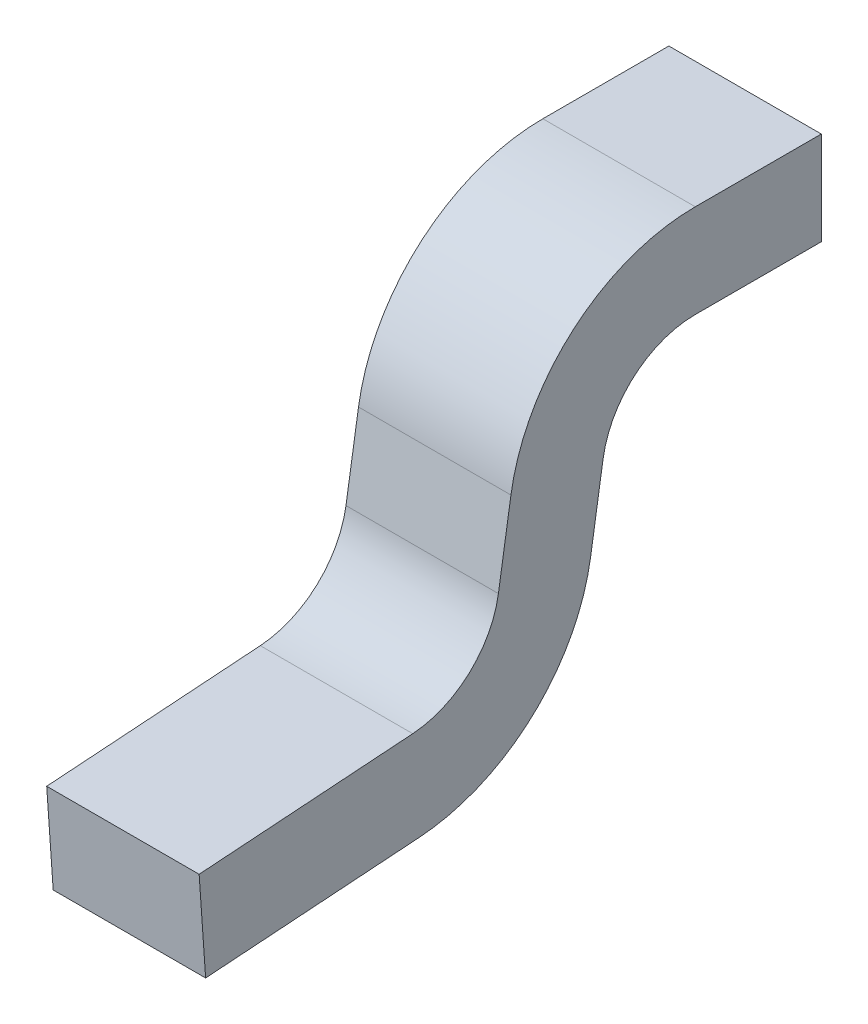
ISO-10303-21;
HEADER;
FILE_DESCRIPTION(('STEP AP214'),'2;1');
FILE_NAME('part.step','',(''),(''),'','','');
FILE_SCHEMA(('AUTOMOTIVE_DESIGN { 1 0 10303 214 1 1 1 1 }'));
ENDSEC;
DATA;
#1=APPLICATION_CONTEXT('core data for automotive mechanical design processes');
#2=APPLICATION_PROTOCOL_DEFINITION('international standard','automotive_design',2000,#1);
#3=PRODUCT_CONTEXT('',#1,'mechanical');
#4=PRODUCT('Part','Part','',(#3));
#5=PRODUCT_RELATED_PRODUCT_CATEGORY('part','',(#4));
#6=PRODUCT_DEFINITION_FORMATION('','',#4);
#7=PRODUCT_DEFINITION_CONTEXT('part definition',#1,'design');
#8=PRODUCT_DEFINITION('design','',#6,#7);
#9=PRODUCT_DEFINITION_SHAPE('','',#8);
#10=(LENGTH_UNIT() NAMED_UNIT(*) SI_UNIT(.MILLI.,.METRE.));
#11=(NAMED_UNIT(*) PLANE_ANGLE_UNIT() SI_UNIT($,.RADIAN.));
#12=(NAMED_UNIT(*) SI_UNIT($,.STERADIAN.) SOLID_ANGLE_UNIT());
#13=UNCERTAINTY_MEASURE_WITH_UNIT(LENGTH_MEASURE(1.E-05),#10,'distance_accuracy_value','');
#14=(GEOMETRIC_REPRESENTATION_CONTEXT(3) GLOBAL_UNCERTAINTY_ASSIGNED_CONTEXT((#13)) GLOBAL_UNIT_ASSIGNED_CONTEXT((#10,
#11,#12)) REPRESENTATION_CONTEXT('',''));
#15=CARTESIAN_POINT('',(0.,0.,0.));
#16=DIRECTION('',(0.,0.,1.));
#17=DIRECTION('',(1.,0.,0.));
#18=AXIS2_PLACEMENT_3D('',#15,#16,#17);
#19=CARTESIAN_POINT('',(0.1225,0.,0.));
#20=DIRECTION('',(1.,0.,0.));
#21=DIRECTION('',(0.,1.,0.));
#22=AXIS2_PLACEMENT_3D('',#19,#20,#21);
#23=PLANE('',#22);
#24=DIRECTION('',(0.,0.98768834059517,-0.156434465040027));
#25=VECTOR('',#24,1.);
#26=CARTESIAN_POINT('',(0.1225,0.04981201057029,0.143980321453));
#27=LINE('',#26,#25);
#28=CARTESIAN_POINT('',(0.1225,0.04981201057029,0.143980321453));
#29=VERTEX_POINT('',#28);
#30=CARTESIAN_POINT('',(0.1225,0.176930339512,0.123846756068));
#31=VERTEX_POINT('',#30);
#32=EDGE_CURVE('E11',#29,#31,#27,.T.);
#33=ORIENTED_EDGE('',*,*,#32,.F.);
#34=CARTESIAN_POINT('',(0.1225,0.07327718032632,0.292133572542));
#35=DIRECTION('',(-1.,0.,0.));
#36=DIRECTION('',(0.,-0.156434465040027,-0.98768834059517));
#37=AXIS2_PLACEMENT_3D('',#34,#35,#36);
#38=CIRCLE('',#37,0.15);
#39=CARTESIAN_POINT('',(0.1225,-0.07635742721265,0.28167010148));
#40=VERTEX_POINT('',#39);
#41=EDGE_CURVE('E43',#29,#40,#38,.T.);
#42=ORIENTED_EDGE('',*,*,#41,.T.);
#43=DIRECTION('',(0.,-0.0697564737441177,0.997564050259825));
#44=VECTOR('',#43,1.);
#45=CARTESIAN_POINT('',(0.1225,-0.07635742721265,0.28167010148));
#46=LINE('',#45,#44);
#47=CARTESIAN_POINT('',(0.1225,-0.100365392461,0.625));
#48=VERTEX_POINT('',#47);
#49=EDGE_CURVE('E240',#40,#48,#46,.T.);
#50=ORIENTED_EDGE('',*,*,#49,.T.);
#51=DIRECTION('',(0.,-0.997564050259826,-0.0697564737441078));
#52=VECTOR('',#51,1.);
#53=CARTESIAN_POINT('',(0.1225,-0.100365392461,0.625));
#54=LINE('',#53,#52);
#55=CARTESIAN_POINT('',(0.1225,-0.25,0.614536528938));
#56=VERTEX_POINT('',#55);
#57=EDGE_CURVE('E260',#48,#56,#54,.T.);
#58=ORIENTED_EDGE('',*,*,#57,.T.);
#59=DIRECTION('',(0.,0.0697564737441177,-0.997564050259825));
#60=VECTOR('',#59,1.);
#61=CARTESIAN_POINT('',(0.1225,-0.25,0.614536528938));
#62=LINE('',#61,#60);
#63=CARTESIAN_POINT('',(0.1225,-0.225992034752,0.271206630419));
#64=VERTEX_POINT('',#63);
#65=EDGE_CURVE('E253',#56,#64,#62,.T.);
#66=ORIENTED_EDGE('',*,*,#65,.T.);
#67=CARTESIAN_POINT('',(0.1225,0.07327718032632,0.292133572542));
#68=DIRECTION('',(1.,0.,0.));
#69=DIRECTION('',(0.,-0.997564050259825,-0.0697564737441177));
#70=AXIS2_PLACEMENT_3D('',#67,#68,#69);
#71=CIRCLE('',#70,0.3);
#72=CARTESIAN_POINT('',(0.1225,0.02634684081425,-0.004172929636685));
#73=VERTEX_POINT('',#72);
#74=EDGE_CURVE('E247',#64,#73,#71,.T.);
#75=ORIENTED_EDGE('',*,*,#74,.T.);
#76=DIRECTION('',(0.,-0.98768834059517,0.156434465040027));
#77=VECTOR('',#76,1.);
#78=CARTESIAN_POINT('',(0.1225,0.153465169756,-0.02430649502112));
#79=LINE('',#78,#77);
#80=CARTESIAN_POINT('',(0.1225,0.153465169756,-0.02430649502112));
#81=VERTEX_POINT('',#80);
#82=EDGE_CURVE('E237',#81,#73,#79,.T.);
#83=ORIENTED_EDGE('',*,*,#82,.F.);
#84=CARTESIAN_POINT('',(0.1225,0.13,-0.17245974611));
#85=DIRECTION('',(-1.,0.,0.));
#86=DIRECTION('',(0.,0.156434465040027,0.98768834059517));
#87=AXIS2_PLACEMENT_3D('',#84,#85,#86);
#88=CIRCLE('',#87,0.15);
#89=CARTESIAN_POINT('',(0.1225,0.28,-0.17245974611));
#90=VERTEX_POINT('',#89);
#91=EDGE_CURVE('E230',#81,#90,#88,.T.);
#92=ORIENTED_EDGE('',*,*,#91,.T.);
#93=DIRECTION('',(0.,0.,-1.));
#94=VECTOR('',#93,1.);
#95=CARTESIAN_POINT('',(0.1225,0.28,-0.17245974611));
#96=LINE('',#95,#94);
#97=CARTESIAN_POINT('',(0.1225,0.28,-0.375));
#98=VERTEX_POINT('',#97);
#99=EDGE_CURVE('E223',#90,#98,#96,.T.);
#100=ORIENTED_EDGE('',*,*,#99,.T.);
#101=DIRECTION('',(0.,1.,0.));
#102=VECTOR('',#101,1.);
#103=CARTESIAN_POINT('',(0.1225,0.28,-0.375));
#104=LINE('',#103,#102);
#105=CARTESIAN_POINT('',(0.1225,0.43,-0.375));
#106=VERTEX_POINT('',#105);
#107=EDGE_CURVE('E216',#98,#106,#104,.T.);
#108=ORIENTED_EDGE('',*,*,#107,.T.);
#109=DIRECTION('',(0.,0.,1.));
#110=VECTOR('',#109,1.);
#111=CARTESIAN_POINT('',(0.1225,0.43,-0.375));
#112=LINE('',#111,#110);
#113=CARTESIAN_POINT('',(0.1225,0.43,-0.17245974611));
#114=VERTEX_POINT('',#113);
#115=EDGE_CURVE('E146',#106,#114,#112,.T.);
#116=ORIENTED_EDGE('',*,*,#115,.T.);
#117=CARTESIAN_POINT('',(0.1225,0.13,-0.17245974611));
#118=DIRECTION('',(1.,0.,0.));
#119=DIRECTION('',(0.,1.,0.));
#120=AXIS2_PLACEMENT_3D('',#117,#118,#119);
#121=CIRCLE('',#120,0.3);
#122=EDGE_CURVE('E141',#114,#31,#121,.T.);
#123=ORIENTED_EDGE('',*,*,#122,.T.);
#124=EDGE_LOOP('',(#33,#42,#50,#58,#66,#75,#83,#92,#100,#108,#116,#123));
#125=FACE_BOUND('',#124,.T.);
#126=ADVANCED_FACE('F17',(#125),#23,.T.);
#127=CARTESIAN_POINT('',(-0.1225,0.02346516975603,0.148153251089));
#128=DIRECTION('',(0.,0.156434465040027,0.98768834059517));
#129=DIRECTION('',(1.,0.,0.));
#130=AXIS2_PLACEMENT_3D('',#127,#128,#129);
#131=PLANE('',#130);
#132=DIRECTION('',(0.,-0.98768834059517,0.156434465040027));
#133=VECTOR('',#132,1.);
#134=CARTESIAN_POINT('',(-0.1225,0.176930339512,0.123846756068));
#135=LINE('',#134,#133);
#136=CARTESIAN_POINT('',(-0.1225,0.176930339512,0.123846756068));
#137=VERTEX_POINT('',#136);
#138=CARTESIAN_POINT('',(-0.1225,0.04981201057029,0.143980321453));
#139=VERTEX_POINT('',#138);
#140=EDGE_CURVE('E155',#137,#139,#135,.T.);
#141=ORIENTED_EDGE('',*,*,#140,.T.);
#142=DIRECTION('',(1.,0.,0.));
#143=VECTOR('',#142,1.);
#144=CARTESIAN_POINT('',(-0.1225,0.04981201057029,0.143980321453));
#145=LINE('',#144,#143);
#146=EDGE_CURVE('E26',#139,#29,#145,.T.);
#147=ORIENTED_EDGE('',*,*,#146,.T.);
#148=ORIENTED_EDGE('',*,*,#32,.T.);
#149=DIRECTION('',(-1.,0.,0.));
#150=VECTOR('',#149,1.);
#151=CARTESIAN_POINT('',(0.1225,0.176930339512,0.123846756068));
#152=LINE('',#151,#150);
#153=EDGE_CURVE('E157',#31,#137,#152,.T.);
#154=ORIENTED_EDGE('',*,*,#153,.T.);
#155=EDGE_LOOP('',(#141,#147,#148,#154));
#156=FACE_BOUND('',#155,.T.);
#157=ADVANCED_FACE('F272',(#156),#131,.T.);
#158=CARTESIAN_POINT('',(-0.441882,0.07327718032632,0.292133572542));
#159=DIRECTION('',(1.,0.,0.));
#160=DIRECTION('',(0.,-0.997564050259825,-0.0697564737441177));
#161=AXIS2_PLACEMENT_3D('',#158,#159,#160);
#162=CYLINDRICAL_SURFACE('',#161,0.15);
#163=ORIENTED_EDGE('',*,*,#41,.F.);
#164=ORIENTED_EDGE('',*,*,#146,.F.);
#165=CARTESIAN_POINT('',(-0.1225,0.07327718032632,0.292133572542));
#166=DIRECTION('',(1.,0.,0.));
#167=DIRECTION('',(0.,-0.997564050259826,-0.0697564737441078));
#168=AXIS2_PLACEMENT_3D('',#165,#166,#167);
#169=CIRCLE('',#168,0.15);
#170=CARTESIAN_POINT('',(-0.1225,-0.07635742721265,0.28167010148));
#171=VERTEX_POINT('',#170);
#172=EDGE_CURVE('E193',#171,#139,#169,.T.);
#173=ORIENTED_EDGE('',*,*,#172,.F.);
#174=DIRECTION('',(1.,0.,0.));
#175=VECTOR('',#174,1.);
#176=CARTESIAN_POINT('',(-0.1225,-0.07635742721265,0.28167010148));
#177=LINE('',#176,#175);
#178=EDGE_CURVE('E211',#171,#40,#177,.T.);
#179=ORIENTED_EDGE('',*,*,#178,.T.);
#180=EDGE_LOOP('',(#163,#164,#173,#179));
#181=FACE_BOUND('',#180,.T.);
#182=ADVANCED_FACE('F19',(#181),#162,.F.);
#183=CARTESIAN_POINT('',(-0.1225,-0.06803440651722,0.162645360267));
#184=DIRECTION('',(0.,0.997564050259825,0.0697564737441177));
#185=DIRECTION('',(1.,0.,0.));
#186=AXIS2_PLACEMENT_3D('',#183,#184,#185);
#187=PLANE('',#186);
#188=DIRECTION('',(0.,-0.0697564737441177,0.997564050259825));
#189=VECTOR('',#188,1.);
#190=CARTESIAN_POINT('',(-0.1225,-0.07635742721265,0.28167010148));
#191=LINE('',#190,#189);
#192=CARTESIAN_POINT('',(-0.1225,-0.100365392461,0.625));
#193=VERTEX_POINT('',#192);
#194=EDGE_CURVE('E198',#171,#193,#191,.T.);
#195=ORIENTED_EDGE('',*,*,#194,.T.);
#196=DIRECTION('',(1.,0.,0.));
#197=VECTOR('',#196,1.);
#198=CARTESIAN_POINT('',(-0.1225,-0.100365392461,0.625));
#199=LINE('',#198,#197);
#200=EDGE_CURVE('E261',#193,#48,#199,.T.);
#201=ORIENTED_EDGE('',*,*,#200,.T.);
#202=ORIENTED_EDGE('',*,*,#49,.F.);
#203=ORIENTED_EDGE('',*,*,#178,.F.);
#204=EDGE_LOOP('',(#195,#201,#202,#203));
#205=FACE_BOUND('',#204,.T.);
#206=ADVANCED_FACE('F278',(#205),#187,.T.);
#207=CARTESIAN_POINT('',(-0.1225,-0.100365392461,0.625));
#208=DIRECTION('',(0.,-0.0697564737441078,0.997564050259826));
#209=DIRECTION('',(-1.,0.,0.));
#210=AXIS2_PLACEMENT_3D('',#207,#208,#209);
#211=PLANE('',#210);
#212=DIRECTION('',(1.,0.,0.));
#213=VECTOR('',#212,1.);
#214=CARTESIAN_POINT('',(-0.1225,-0.25,0.614536528938));
#215=LINE('',#214,#213);
#216=CARTESIAN_POINT('',(-0.1225,-0.25,0.614536528938));
#217=VERTEX_POINT('',#216);
#218=EDGE_CURVE('E256',#217,#56,#215,.T.);
#219=ORIENTED_EDGE('',*,*,#218,.T.);
#220=ORIENTED_EDGE('',*,*,#57,.F.);
#221=ORIENTED_EDGE('',*,*,#200,.F.);
#222=DIRECTION('',(0.,-0.997564050259826,-0.0697564737441078));
#223=VECTOR('',#222,1.);
#224=CARTESIAN_POINT('',(-0.1225,-0.100365392461,0.625));
#225=LINE('',#224,#223);
#226=EDGE_CURVE('E194',#193,#217,#225,.T.);
#227=ORIENTED_EDGE('',*,*,#226,.T.);
#228=EDGE_LOOP('',(#219,#220,#221,#227));
#229=FACE_BOUND('',#228,.T.);
#230=ADVANCED_FACE('F283',(#229),#211,.T.);
#231=CARTESIAN_POINT('',(-0.1225,-0.25,0.614536528938));
#232=DIRECTION('',(0.,-0.997564050259825,-0.0697564737441177));
#233=DIRECTION('',(0.,0.0697564737441177,-0.997564050259825));
#234=AXIS2_PLACEMENT_3D('',#231,#232,#233);
#235=PLANE('',#234);
#236=ORIENTED_EDGE('',*,*,#65,.F.);
#237=ORIENTED_EDGE('',*,*,#218,.F.);
#238=DIRECTION('',(0.,0.0697564737441177,-0.997564050259825));
#239=VECTOR('',#238,1.);
#240=CARTESIAN_POINT('',(-0.1225,-0.25,0.614536528938));
#241=LINE('',#240,#239);
#242=CARTESIAN_POINT('',(-0.1225,-0.225992034752,0.271206630419));
#243=VERTEX_POINT('',#242);
#244=EDGE_CURVE('E179',#217,#243,#241,.T.);
#245=ORIENTED_EDGE('',*,*,#244,.T.);
#246=DIRECTION('',(-1.,0.,0.));
#247=VECTOR('',#246,1.);
#248=CARTESIAN_POINT('',(0.1225,-0.225992034752,0.271206630419));
#249=LINE('',#248,#247);
#250=EDGE_CURVE('E250',#64,#243,#249,.T.);
#251=ORIENTED_EDGE('',*,*,#250,.F.);
#252=EDGE_LOOP('',(#236,#237,#245,#251));
#253=FACE_BOUND('',#252,.T.);
#254=ADVANCED_FACE('F287',(#253),#235,.T.);
#255=CARTESIAN_POINT('',(0.508014,0.07327718032632,0.292133572542));
#256=DIRECTION('',(-1.,0.,0.));
#257=DIRECTION('',(0.,-0.156434465040027,-0.98768834059517));
#258=AXIS2_PLACEMENT_3D('',#255,#256,#257);
#259=CYLINDRICAL_SURFACE('',#258,0.3);
#260=DIRECTION('',(-1.,0.,0.));
#261=VECTOR('',#260,1.);
#262=CARTESIAN_POINT('',(0.1225,0.02634684081425,-0.004172929636685));
#263=LINE('',#262,#261);
#264=CARTESIAN_POINT('',(-0.1225,0.02634684081425,-0.004172929636685));
#265=VERTEX_POINT('',#264);
#266=EDGE_CURVE('E244',#73,#265,#263,.T.);
#267=ORIENTED_EDGE('',*,*,#266,.F.);
#268=ORIENTED_EDGE('',*,*,#74,.F.);
#269=ORIENTED_EDGE('',*,*,#250,.T.);
#270=CARTESIAN_POINT('',(-0.1225,0.07327718032632,0.292133572542));
#271=DIRECTION('',(-1.,0.,0.));
#272=DIRECTION('',(0.,-0.156434465040027,-0.98768834059517));
#273=AXIS2_PLACEMENT_3D('',#270,#271,#272);
#274=CIRCLE('',#273,0.3);
#275=EDGE_CURVE('E175',#265,#243,#274,.T.);
#276=ORIENTED_EDGE('',*,*,#275,.F.);
#277=EDGE_LOOP('',(#267,#268,#269,#276));
#278=FACE_BOUND('',#277,.T.);
#279=ADVANCED_FACE('F292',(#278),#259,.T.);
#280=CARTESIAN_POINT('',(-0.1225,-0.209345993361,0.03315714799263));
#281=DIRECTION('',(0.,-0.156434465040027,-0.98768834059517));
#282=DIRECTION('',(0.,-0.98768834059517,0.156434465040027));
#283=AXIS2_PLACEMENT_3D('',#280,#281,#282);
#284=PLANE('',#283);
#285=DIRECTION('',(0.,0.98768834059517,-0.156434465040027));
#286=VECTOR('',#285,1.);
#287=CARTESIAN_POINT('',(-0.1225,0.02634684081425,-0.004172929636685));
#288=LINE('',#287,#286);
#289=CARTESIAN_POINT('',(-0.1225,0.153465169756,-0.02430649502112));
#290=VERTEX_POINT('',#289);
#291=EDGE_CURVE('E180',#265,#290,#288,.T.);
#292=ORIENTED_EDGE('',*,*,#291,.T.);
#293=DIRECTION('',(1.,0.,0.));
#294=VECTOR('',#293,1.);
#295=CARTESIAN_POINT('',(-0.1225,0.153465169756,-0.02430649502112));
#296=LINE('',#295,#294);
#297=EDGE_CURVE('E233',#290,#81,#296,.T.);
#298=ORIENTED_EDGE('',*,*,#297,.T.);
#299=ORIENTED_EDGE('',*,*,#82,.T.);
#300=ORIENTED_EDGE('',*,*,#266,.T.);
#301=EDGE_LOOP('',(#292,#298,#299,#300));
#302=FACE_BOUND('',#301,.T.);
#303=ADVANCED_FACE('F295',(#302),#284,.T.);
#304=CARTESIAN_POINT('',(-0.441882,0.13,-0.17245974611));
#305=DIRECTION('',(1.,0.,0.));
#306=DIRECTION('',(0.,1.,0.));
#307=AXIS2_PLACEMENT_3D('',#304,#305,#306);
#308=CYLINDRICAL_SURFACE('',#307,0.15);
#309=ORIENTED_EDGE('',*,*,#91,.F.);
#310=ORIENTED_EDGE('',*,*,#297,.F.);
#311=CARTESIAN_POINT('',(-0.1225,0.13,-0.17245974611));
#312=DIRECTION('',(1.,0.,0.));
#313=DIRECTION('',(0.,1.,0.));
#314=AXIS2_PLACEMENT_3D('',#311,#312,#313);
#315=CIRCLE('',#314,0.15);
#316=CARTESIAN_POINT('',(-0.1225,0.28,-0.17245974611));
#317=VERTEX_POINT('',#316);
#318=EDGE_CURVE('E184',#317,#290,#315,.T.);
#319=ORIENTED_EDGE('',*,*,#318,.F.);
#320=DIRECTION('',(1.,0.,0.));
#321=VECTOR('',#320,1.);
#322=CARTESIAN_POINT('',(-0.1225,0.28,-0.17245974611));
#323=LINE('',#322,#321);
#324=EDGE_CURVE('E226',#317,#90,#323,.T.);
#325=ORIENTED_EDGE('',*,*,#324,.T.);
#326=EDGE_LOOP('',(#309,#310,#319,#325));
#327=FACE_BOUND('',#326,.T.);
#328=ADVANCED_FACE('F299',(#327),#308,.F.);
#329=CARTESIAN_POINT('',(-0.1225,0.28,-0.04434764329087));
#330=DIRECTION('',(0.,-1.,0.));
#331=DIRECTION('',(0.,0.,-1.));
#332=AXIS2_PLACEMENT_3D('',#329,#330,#331);
#333=PLANE('',#332);
#334=DIRECTION('',(0.,0.,-1.));
#335=VECTOR('',#334,1.);
#336=CARTESIAN_POINT('',(-0.1225,0.28,-0.17245974611));
#337=LINE('',#336,#335);
#338=CARTESIAN_POINT('',(-0.1225,0.28,-0.375));
#339=VERTEX_POINT('',#338);
#340=EDGE_CURVE('E170',#317,#339,#337,.T.);
#341=ORIENTED_EDGE('',*,*,#340,.T.);
#342=DIRECTION('',(1.,0.,0.));
#343=VECTOR('',#342,1.);
#344=CARTESIAN_POINT('',(-0.1225,0.28,-0.375));
#345=LINE('',#344,#343);
#346=EDGE_CURVE('E219',#339,#98,#345,.T.);
#347=ORIENTED_EDGE('',*,*,#346,.T.);
#348=ORIENTED_EDGE('',*,*,#99,.F.);
#349=ORIENTED_EDGE('',*,*,#324,.F.);
#350=EDGE_LOOP('',(#341,#347,#348,#349));
#351=FACE_BOUND('',#350,.T.);
#352=ADVANCED_FACE('F303',(#351),#333,.T.);
#353=CARTESIAN_POINT('',(-0.1225,0.28,-0.375));
#354=DIRECTION('',(0.,0.,-1.));
#355=DIRECTION('',(0.,-1.,0.));
#356=AXIS2_PLACEMENT_3D('',#353,#354,#355);
#357=PLANE('',#356);
#358=DIRECTION('',(1.,0.,0.));
#359=VECTOR('',#358,1.);
#360=CARTESIAN_POINT('',(-0.1225,0.43,-0.375));
#361=LINE('',#360,#359);
#362=CARTESIAN_POINT('',(-0.1225,0.43,-0.375));
#363=VERTEX_POINT('',#362);
#364=EDGE_CURVE('E161',#363,#106,#361,.T.);
#365=ORIENTED_EDGE('',*,*,#364,.T.);
#366=ORIENTED_EDGE('',*,*,#107,.F.);
#367=ORIENTED_EDGE('',*,*,#346,.F.);
#368=DIRECTION('',(0.,1.,0.));
#369=VECTOR('',#368,1.);
#370=CARTESIAN_POINT('',(-0.1225,0.28,-0.375));
#371=LINE('',#370,#369);
#372=EDGE_CURVE('E164',#339,#363,#371,.T.);
#373=ORIENTED_EDGE('',*,*,#372,.T.);
#374=EDGE_LOOP('',(#365,#366,#367,#373));
#375=FACE_BOUND('',#374,.T.);
#376=ADVANCED_FACE('F306',(#375),#357,.T.);
#377=CARTESIAN_POINT('',(-0.1225,0.43,-0.375));
#378=DIRECTION('',(0.,1.,0.));
#379=DIRECTION('',(1.,0.,0.));
#380=AXIS2_PLACEMENT_3D('',#377,#378,#379);
#381=PLANE('',#380);
#382=ORIENTED_EDGE('',*,*,#115,.F.);
#383=ORIENTED_EDGE('',*,*,#364,.F.);
#384=DIRECTION('',(0.,0.,1.));
#385=VECTOR('',#384,1.);
#386=CARTESIAN_POINT('',(-0.1225,0.43,-0.375));
#387=LINE('',#386,#385);
#388=CARTESIAN_POINT('',(-0.1225,0.43,-0.17245974611));
#389=VERTEX_POINT('',#388);
#390=EDGE_CURVE('E152',#363,#389,#387,.T.);
#391=ORIENTED_EDGE('',*,*,#390,.T.);
#392=DIRECTION('',(-1.,0.,0.));
#393=VECTOR('',#392,1.);
#394=CARTESIAN_POINT('',(0.1225,0.43,-0.17245974611));
#395=LINE('',#394,#393);
#396=EDGE_CURVE('E135',#114,#389,#395,.T.);
#397=ORIENTED_EDGE('',*,*,#396,.F.);
#398=EDGE_LOOP('',(#382,#383,#391,#397));
#399=FACE_BOUND('',#398,.T.);
#400=ADVANCED_FACE('F159',(#399),#381,.T.);
#401=CARTESIAN_POINT('',(0.508014,0.13,-0.17245974611));
#402=DIRECTION('',(-1.,0.,0.));
#403=DIRECTION('',(0.,0.156434465040027,0.98768834059517));
#404=AXIS2_PLACEMENT_3D('',#401,#402,#403);
#405=CYLINDRICAL_SURFACE('',#404,0.3);
#406=ORIENTED_EDGE('',*,*,#153,.F.);
#407=ORIENTED_EDGE('',*,*,#122,.F.);
#408=ORIENTED_EDGE('',*,*,#396,.T.);
#409=CARTESIAN_POINT('',(-0.1225,0.13,-0.17245974611));
#410=DIRECTION('',(-1.,0.,0.));
#411=DIRECTION('',(0.,0.156434465040027,0.98768834059517));
#412=AXIS2_PLACEMENT_3D('',#409,#410,#411);
#413=CIRCLE('',#412,0.3);
#414=EDGE_CURVE('E139',#137,#389,#413,.T.);
#415=ORIENTED_EDGE('',*,*,#414,.F.);
#416=EDGE_LOOP('',(#406,#407,#408,#415));
#417=FACE_BOUND('',#416,.T.);
#418=ADVANCED_FACE('F138',(#417),#405,.T.);
#419=CARTESIAN_POINT('',(-0.1225,0.,0.));
#420=DIRECTION('',(1.,0.,0.));
#421=DIRECTION('',(0.,1.,0.));
#422=AXIS2_PLACEMENT_3D('',#419,#420,#421);
#423=PLANE('',#422);
#424=ORIENTED_EDGE('',*,*,#390,.F.);
#425=ORIENTED_EDGE('',*,*,#372,.F.);
#426=ORIENTED_EDGE('',*,*,#340,.F.);
#427=ORIENTED_EDGE('',*,*,#318,.T.);
#428=ORIENTED_EDGE('',*,*,#291,.F.);
#429=ORIENTED_EDGE('',*,*,#275,.T.);
#430=ORIENTED_EDGE('',*,*,#244,.F.);
#431=ORIENTED_EDGE('',*,*,#226,.F.);
#432=ORIENTED_EDGE('',*,*,#194,.F.);
#433=ORIENTED_EDGE('',*,*,#172,.T.);
#434=ORIENTED_EDGE('',*,*,#140,.F.);
#435=ORIENTED_EDGE('',*,*,#414,.T.);
#436=EDGE_LOOP('',(#424,#425,#426,#427,#428,#429,#430,#431,#432,#433,#434,#435));
#437=FACE_BOUND('',#436,.T.);
#438=ADVANCED_FACE('F150',(#437),#423,.F.);
#439=CLOSED_SHELL('',(#126,#157,#182,#206,#230,#254,#279,#303,#328,#352,#376,#400,#418,#438));
#440=MANIFOLD_SOLID_BREP('B1',#439);
#441=ADVANCED_BREP_SHAPE_REPRESENTATION('',(#18,#440),#14);
#442=SHAPE_DEFINITION_REPRESENTATION(#9,#441);
ENDSEC;
END-ISO-10303-21;
